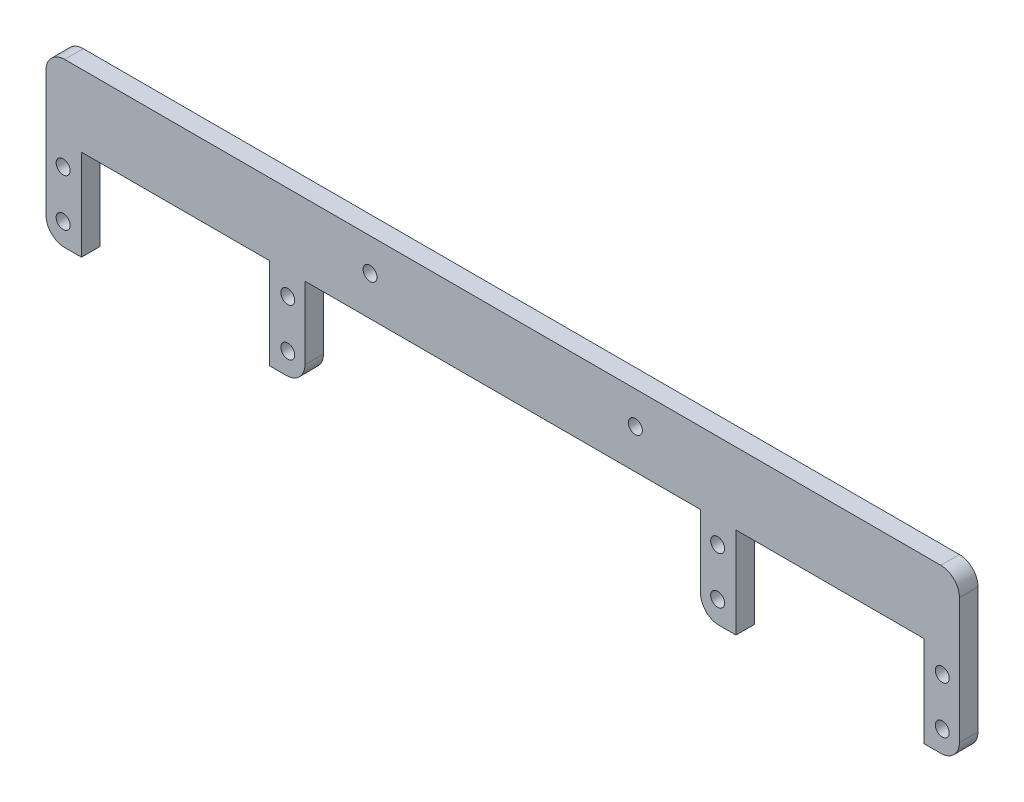
ISO-10303-21;
HEADER;
FILE_DESCRIPTION(('STEP AP214'),'2;1');
FILE_NAME('part.step','',(''),(''),'','','');
FILE_SCHEMA(('AUTOMOTIVE_DESIGN { 1 0 10303 214 1 1 1 1 }'));
ENDSEC;
DATA;
#1=APPLICATION_CONTEXT('core data for automotive mechanical design processes');
#2=APPLICATION_PROTOCOL_DEFINITION('international standard','automotive_design',2000,#1);
#3=PRODUCT_CONTEXT('',#1,'mechanical');
#4=PRODUCT('Part','Part','',(#3));
#5=PRODUCT_RELATED_PRODUCT_CATEGORY('part','',(#4));
#6=PRODUCT_DEFINITION_FORMATION('','',#4);
#7=PRODUCT_DEFINITION_CONTEXT('part definition',#1,'design');
#8=PRODUCT_DEFINITION('design','',#6,#7);
#9=PRODUCT_DEFINITION_SHAPE('','',#8);
#10=(LENGTH_UNIT() NAMED_UNIT(*) SI_UNIT(.MILLI.,.METRE.));
#11=(NAMED_UNIT(*) PLANE_ANGLE_UNIT() SI_UNIT($,.RADIAN.));
#12=(NAMED_UNIT(*) SI_UNIT($,.STERADIAN.) SOLID_ANGLE_UNIT());
#13=UNCERTAINTY_MEASURE_WITH_UNIT(LENGTH_MEASURE(1.E-05),#10,'distance_accuracy_value','');
#14=(GEOMETRIC_REPRESENTATION_CONTEXT(3) GLOBAL_UNCERTAINTY_ASSIGNED_CONTEXT((#13)) GLOBAL_UNIT_ASSIGNED_CONTEXT((#10,
#11,#12)) REPRESENTATION_CONTEXT('',''));
#15=CARTESIAN_POINT('',(0.,0.,0.));
#16=DIRECTION('',(0.,0.,1.));
#17=DIRECTION('',(1.,0.,0.));
#18=AXIS2_PLACEMENT_3D('',#15,#16,#17);
#19=CARTESIAN_POINT('',(0.,32.3655253772291,4.));
#20=DIRECTION('',(0.,1.,0.));
#21=DIRECTION('',(0.,0.,1.));
#22=AXIS2_PLACEMENT_3D('',#19,#20,#21);
#23=PLANE('',#22);
#24=DIRECTION('',(1.,0.,0.));
#25=VECTOR('',#24,1.);
#26=CARTESIAN_POINT('',(0.,32.3655253772291,0.));
#27=LINE('',#26,#25);
#28=CARTESIAN_POINT('',(-211.327093968146,32.3655253772291,0.));
#29=VERTEX_POINT('',#28);
#30=CARTESIAN_POINT('',(-23.0750939681456,32.3655253772291,0.));
#31=VERTEX_POINT('',#30);
#32=EDGE_CURVE('E258',#29,#31,#27,.T.);
#33=ORIENTED_EDGE('',*,*,#32,.F.);
#34=DIRECTION('',(0.,0.,-1.));
#35=VECTOR('',#34,1.);
#36=CARTESIAN_POINT('',(-211.327093968146,32.3655253772291,4.));
#37=LINE('',#36,#35);
#38=CARTESIAN_POINT('',(-211.327093968146,32.3655253772291,4.));
#39=VERTEX_POINT('',#38);
#40=EDGE_CURVE('E11',#29,#39,#37,.F.);
#41=ORIENTED_EDGE('',*,*,#40,.T.);
#42=DIRECTION('',(1.,0.,0.));
#43=VECTOR('',#42,1.);
#44=CARTESIAN_POINT('',(0.,32.3655253772291,4.));
#45=LINE('',#44,#43);
#46=CARTESIAN_POINT('',(-23.0750939681456,32.3655253772291,4.));
#47=VERTEX_POINT('',#46);
#48=EDGE_CURVE('E303',#39,#47,#45,.T.);
#49=ORIENTED_EDGE('',*,*,#48,.T.);
#50=DIRECTION('',(0.,0.,-1.));
#51=VECTOR('',#50,1.);
#52=CARTESIAN_POINT('',(-23.0750939681456,32.3655253772291,0.));
#53=LINE('',#52,#51);
#54=EDGE_CURVE('E42',#47,#31,#53,.T.);
#55=ORIENTED_EDGE('',*,*,#54,.T.);
#56=EDGE_LOOP('',(#33,#41,#49,#55));
#57=FACE_BOUND('',#56,.T.);
#58=ADVANCED_FACE('F34',(#57),#23,.T.);
#59=CARTESIAN_POINT('',(-215.327093968146,0.,4.));
#60=DIRECTION('',(-1.,0.,0.));
#61=DIRECTION('',(0.,0.,1.));
#62=AXIS2_PLACEMENT_3D('',#59,#60,#61);
#63=PLANE('',#62);
#64=DIRECTION('',(0.,1.,0.));
#65=VECTOR('',#64,1.);
#66=CARTESIAN_POINT('',(-215.327093968146,0.,0.));
#67=LINE('',#66,#65);
#68=CARTESIAN_POINT('',(-215.327093968146,1.36552537722908,0.));
#69=VERTEX_POINT('',#68);
#70=CARTESIAN_POINT('',(-215.327093968146,28.3655253772291,0.));
#71=VERTEX_POINT('',#70);
#72=EDGE_CURVE('E261',#69,#71,#67,.T.);
#73=ORIENTED_EDGE('',*,*,#72,.F.);
#74=DIRECTION('',(0.,0.,-1.));
#75=VECTOR('',#74,1.);
#76=CARTESIAN_POINT('',(-215.327093968146,1.36552537722908,4.));
#77=LINE('',#76,#75);
#78=CARTESIAN_POINT('',(-215.327093968146,1.36552537722908,4.));
#79=VERTEX_POINT('',#78);
#80=EDGE_CURVE('E366',#69,#79,#77,.F.);
#81=ORIENTED_EDGE('',*,*,#80,.T.);
#82=DIRECTION('',(0.,1.,0.));
#83=VECTOR('',#82,1.);
#84=CARTESIAN_POINT('',(-215.327093968146,0.,4.));
#85=LINE('',#84,#83);
#86=CARTESIAN_POINT('',(-215.327093968146,28.3655253772291,4.));
#87=VERTEX_POINT('',#86);
#88=EDGE_CURVE('E220',#79,#87,#85,.T.);
#89=ORIENTED_EDGE('',*,*,#88,.T.);
#90=DIRECTION('',(0.,0.,-1.));
#91=VECTOR('',#90,1.);
#92=CARTESIAN_POINT('',(-215.327093968146,28.3655253772291,4.));
#93=LINE('',#92,#91);
#94=EDGE_CURVE('E363',#87,#71,#93,.T.);
#95=ORIENTED_EDGE('',*,*,#94,.T.);
#96=EDGE_LOOP('',(#73,#81,#89,#95));
#97=FACE_BOUND('',#96,.T.);
#98=ADVANCED_FACE('F393',(#97),#63,.T.);
#99=CARTESIAN_POINT('',(0.,-2.63447462277092,4.));
#100=DIRECTION('',(0.,-1.,0.));
#101=DIRECTION('',(0.,0.,-1.));
#102=AXIS2_PLACEMENT_3D('',#99,#100,#101);
#103=PLANE('',#102);
#104=DIRECTION('',(-1.,0.,0.));
#105=VECTOR('',#104,1.);
#106=CARTESIAN_POINT('',(0.,-2.63447462277092,4.));
#107=LINE('',#106,#105);
#108=CARTESIAN_POINT('',(-207.707093968146,-2.63447462277092,4.));
#109=VERTEX_POINT('',#108);
#110=CARTESIAN_POINT('',(-211.327093968146,-2.63447462277092,4.));
#111=VERTEX_POINT('',#110);
#112=EDGE_CURVE('E200',#109,#111,#107,.T.);
#113=ORIENTED_EDGE('',*,*,#112,.T.);
#114=DIRECTION('',(0.,0.,-1.));
#115=VECTOR('',#114,1.);
#116=CARTESIAN_POINT('',(-211.327093968146,-2.63447462277092,4.));
#117=LINE('',#116,#115);
#118=CARTESIAN_POINT('',(-211.327093968146,-2.63447462277092,0.));
#119=VERTEX_POINT('',#118);
#120=EDGE_CURVE('E361',#111,#119,#117,.T.);
#121=ORIENTED_EDGE('',*,*,#120,.T.);
#122=DIRECTION('',(-1.,0.,0.));
#123=VECTOR('',#122,1.);
#124=CARTESIAN_POINT('',(0.,-2.63447462277092,0.));
#125=LINE('',#124,#123);
#126=CARTESIAN_POINT('',(-207.707093968146,-2.63447462277092,0.));
#127=VERTEX_POINT('',#126);
#128=EDGE_CURVE('E203',#127,#119,#125,.T.);
#129=ORIENTED_EDGE('',*,*,#128,.F.);
#130=DIRECTION('',(0.,0.,-1.));
#131=VECTOR('',#130,1.);
#132=CARTESIAN_POINT('',(-207.707093968146,-2.63447462277092,4.));
#133=LINE('',#132,#131);
#134=EDGE_CURVE('E196',#109,#127,#133,.T.);
#135=ORIENTED_EDGE('',*,*,#134,.F.);
#136=EDGE_LOOP('',(#113,#121,#129,#135));
#137=FACE_BOUND('',#136,.T.);
#138=ADVANCED_FACE('F198',(#137),#103,.T.);
#139=CARTESIAN_POINT('',(-207.707093968146,0.,4.));
#140=DIRECTION('',(1.,0.,0.));
#141=DIRECTION('',(0.,0.,-1.));
#142=AXIS2_PLACEMENT_3D('',#139,#140,#141);
#143=PLANE('',#142);
#144=DIRECTION('',(0.,-1.,0.));
#145=VECTOR('',#144,1.);
#146=CARTESIAN_POINT('',(-207.707093968146,0.,0.));
#147=LINE('',#146,#145);
#148=CARTESIAN_POINT('',(-207.707093968146,16.9235253772291,0.));
#149=VERTEX_POINT('',#148);
#150=EDGE_CURVE('E266',#149,#127,#147,.T.);
#151=ORIENTED_EDGE('',*,*,#150,.F.);
#152=DIRECTION('',(0.,0.,-1.));
#153=VECTOR('',#152,1.);
#154=CARTESIAN_POINT('',(-207.707093968146,16.9235253772291,4.));
#155=LINE('',#154,#153);
#156=CARTESIAN_POINT('',(-207.707093968146,16.9235253772291,4.));
#157=VERTEX_POINT('',#156);
#158=EDGE_CURVE('E209',#157,#149,#155,.T.);
#159=ORIENTED_EDGE('',*,*,#158,.F.);
#160=DIRECTION('',(0.,-1.,0.));
#161=VECTOR('',#160,1.);
#162=CARTESIAN_POINT('',(-207.707093968146,0.,4.));
#163=LINE('',#162,#161);
#164=EDGE_CURVE('E215',#157,#109,#163,.T.);
#165=ORIENTED_EDGE('',*,*,#164,.T.);
#166=ORIENTED_EDGE('',*,*,#134,.T.);
#167=EDGE_LOOP('',(#151,#159,#165,#166));
#168=FACE_BOUND('',#167,.T.);
#169=ADVANCED_FACE('F222',(#168),#143,.T.);
#170=CARTESIAN_POINT('',(0.,16.9235253772291,4.));
#171=DIRECTION('',(0.,-1.,0.));
#172=DIRECTION('',(0.,0.,-1.));
#173=AXIS2_PLACEMENT_3D('',#170,#171,#172);
#174=PLANE('',#173);
#175=DIRECTION('',(-1.,0.,0.));
#176=VECTOR('',#175,1.);
#177=CARTESIAN_POINT('',(0.,16.9235253772291,0.));
#178=LINE('',#177,#176);
#179=CARTESIAN_POINT('',(-167.321093968146,16.9235253772291,0.));
#180=VERTEX_POINT('',#179);
#181=EDGE_CURVE('E268',#180,#149,#178,.T.);
#182=ORIENTED_EDGE('',*,*,#181,.F.);
#183=DIRECTION('',(0.,0.,-1.));
#184=VECTOR('',#183,1.);
#185=CARTESIAN_POINT('',(-167.321093968146,16.9235253772291,4.));
#186=LINE('',#185,#184);
#187=CARTESIAN_POINT('',(-167.321093968146,16.9235253772291,4.));
#188=VERTEX_POINT('',#187);
#189=EDGE_CURVE('E327',#188,#180,#186,.T.);
#190=ORIENTED_EDGE('',*,*,#189,.F.);
#191=DIRECTION('',(-1.,0.,0.));
#192=VECTOR('',#191,1.);
#193=CARTESIAN_POINT('',(0.,16.9235253772291,4.));
#194=LINE('',#193,#192);
#195=EDGE_CURVE('E223',#188,#157,#194,.T.);
#196=ORIENTED_EDGE('',*,*,#195,.T.);
#197=ORIENTED_EDGE('',*,*,#158,.T.);
#198=EDGE_LOOP('',(#182,#190,#196,#197));
#199=FACE_BOUND('',#198,.T.);
#200=ADVANCED_FACE('F827',(#199),#174,.T.);
#201=CARTESIAN_POINT('',(-129.794494110069,-61.8400685254336,4.));
#202=DIRECTION('',(0.9027709537187,0.430121616664205,0.));
#203=DIRECTION('',(-0.430121616664205,0.9027709537187,0.));
#204=AXIS2_PLACEMENT_3D('',#201,#202,#203);
#205=PLANE('',#204);
#206=DIRECTION('',(0.430121616664205,-0.9027709537187,0.));
#207=VECTOR('',#206,1.);
#208=CARTESIAN_POINT('',(-129.794494110069,-61.8400685254336,0.));
#209=LINE('',#208,#207);
#210=CARTESIAN_POINT('',(-167.231910297222,16.7363401148836,0.));
#211=VERTEX_POINT('',#210);
#212=EDGE_CURVE('E271',#180,#211,#209,.T.);
#213=ORIENTED_EDGE('',*,*,#212,.T.);
#214=DIRECTION('',(0.,0.,-1.));
#215=VECTOR('',#214,1.);
#216=CARTESIAN_POINT('',(-167.231910297222,16.7363401148836,4.));
#217=LINE('',#216,#215);
#218=CARTESIAN_POINT('',(-167.231910297222,16.7363401148836,4.));
#219=VERTEX_POINT('',#218);
#220=EDGE_CURVE('E325',#219,#211,#217,.T.);
#221=ORIENTED_EDGE('',*,*,#220,.F.);
#222=DIRECTION('',(0.430121616664205,-0.9027709537187,0.));
#223=VECTOR('',#222,1.);
#224=CARTESIAN_POINT('',(-129.794494110069,-61.8400685254336,4.));
#225=LINE('',#224,#223);
#226=EDGE_CURVE('E225',#188,#219,#225,.T.);
#227=ORIENTED_EDGE('',*,*,#226,.F.);
#228=ORIENTED_EDGE('',*,*,#189,.T.);
#229=EDGE_LOOP('',(#213,#221,#227,#228));
#230=FACE_BOUND('',#229,.T.);
#231=ADVANCED_FACE('F817',(#230),#205,.F.);
#232=CARTESIAN_POINT('',(0.0738221222793477,15.9626026151486,4.));
#233=DIRECTION('',(0.00462464264921358,0.999989306283006,0.));
#234=DIRECTION('',(-0.999989306283006,0.00462464264921358,0.));
#235=AXIS2_PLACEMENT_3D('',#232,#233,#234);
#236=PLANE('',#235);
#237=DIRECTION('',(0.999989306283006,-0.00462464264921357,0.));
#238=VECTOR('',#237,1.);
#239=CARTESIAN_POINT('',(0.0738221222793477,15.9626026151486,0.));
#240=LINE('',#239,#238);
#241=CARTESIAN_POINT('',(-167.321093968146,16.7367525619023,0.));
#242=VERTEX_POINT('',#241);
#243=EDGE_CURVE('E274',#242,#211,#240,.T.);
#244=ORIENTED_EDGE('',*,*,#243,.F.);
#245=DIRECTION('',(0.,0.,-1.));
#246=VECTOR('',#245,1.);
#247=CARTESIAN_POINT('',(-167.321093968146,16.7367525619023,4.));
#248=LINE('',#247,#246);
#249=CARTESIAN_POINT('',(-167.321093968146,16.7367525619023,4.));
#250=VERTEX_POINT('',#249);
#251=EDGE_CURVE('E323',#250,#242,#248,.T.);
#252=ORIENTED_EDGE('',*,*,#251,.F.);
#253=DIRECTION('',(0.999989306283006,-0.00462464264921357,0.));
#254=VECTOR('',#253,1.);
#255=CARTESIAN_POINT('',(0.0738221222793477,15.9626026151486,4.));
#256=LINE('',#255,#254);
#257=EDGE_CURVE('E230',#250,#219,#256,.T.);
#258=ORIENTED_EDGE('',*,*,#257,.T.);
#259=ORIENTED_EDGE('',*,*,#220,.T.);
#260=EDGE_LOOP('',(#244,#252,#258,#259));
#261=FACE_BOUND('',#260,.T.);
#262=ADVANCED_FACE('F807',(#261),#236,.T.);
#263=CARTESIAN_POINT('',(-167.321093968146,0.,4.));
#264=DIRECTION('',(-1.,0.,0.));
#265=DIRECTION('',(0.,0.,1.));
#266=AXIS2_PLACEMENT_3D('',#263,#264,#265);
#267=PLANE('',#266);
#268=DIRECTION('',(0.,1.,0.));
#269=VECTOR('',#268,1.);
#270=CARTESIAN_POINT('',(-167.321093968146,0.,0.));
#271=LINE('',#270,#269);
#272=CARTESIAN_POINT('',(-167.321093968146,-2.63447462277092,0.));
#273=VERTEX_POINT('',#272);
#274=EDGE_CURVE('E277',#273,#242,#271,.T.);
#275=ORIENTED_EDGE('',*,*,#274,.F.);
#276=DIRECTION('',(0.,0.,-1.));
#277=VECTOR('',#276,1.);
#278=CARTESIAN_POINT('',(-167.321093968146,-2.63447462277092,4.));
#279=LINE('',#278,#277);
#280=CARTESIAN_POINT('',(-167.321093968146,-2.63447462277092,4.));
#281=VERTEX_POINT('',#280);
#282=EDGE_CURVE('E320',#281,#273,#279,.T.);
#283=ORIENTED_EDGE('',*,*,#282,.F.);
#284=DIRECTION('',(0.,1.,0.));
#285=VECTOR('',#284,1.);
#286=CARTESIAN_POINT('',(-167.321093968146,0.,4.));
#287=LINE('',#286,#285);
#288=EDGE_CURVE('E233',#281,#250,#287,.T.);
#289=ORIENTED_EDGE('',*,*,#288,.T.);
#290=ORIENTED_EDGE('',*,*,#251,.T.);
#291=EDGE_LOOP('',(#275,#283,#289,#290));
#292=FACE_BOUND('',#291,.T.);
#293=ADVANCED_FACE('F746',(#292),#267,.T.);
#294=CARTESIAN_POINT('',(0.,-2.63447462277092,4.));
#295=DIRECTION('',(0.,-1.,0.));
#296=DIRECTION('',(0.,0.,-1.));
#297=AXIS2_PLACEMENT_3D('',#294,#295,#296);
#298=PLANE('',#297);
#299=DIRECTION('',(-1.,0.,0.));
#300=VECTOR('',#299,1.);
#301=CARTESIAN_POINT('',(0.,-2.63447462277092,0.));
#302=LINE('',#301,#300);
#303=CARTESIAN_POINT('',(-163.701093968146,-2.63447462277092,0.));
#304=VERTEX_POINT('',#303);
#305=EDGE_CURVE('E280',#304,#273,#302,.T.);
#306=ORIENTED_EDGE('',*,*,#305,.F.);
#307=DIRECTION('',(0.,0.,-1.));
#308=VECTOR('',#307,1.);
#309=CARTESIAN_POINT('',(-163.701093968146,-2.63447462277092,4.));
#310=LINE('',#309,#308);
#311=CARTESIAN_POINT('',(-163.701093968146,-2.63447462277092,4.));
#312=VERTEX_POINT('',#311);
#313=EDGE_CURVE('E359',#304,#312,#310,.F.);
#314=ORIENTED_EDGE('',*,*,#313,.T.);
#315=DIRECTION('',(-1.,0.,0.));
#316=VECTOR('',#315,1.);
#317=CARTESIAN_POINT('',(0.,-2.63447462277092,4.));
#318=LINE('',#317,#316);
#319=EDGE_CURVE('E236',#312,#281,#318,.T.);
#320=ORIENTED_EDGE('',*,*,#319,.T.);
#321=ORIENTED_EDGE('',*,*,#282,.T.);
#322=EDGE_LOOP('',(#306,#314,#320,#321));
#323=FACE_BOUND('',#322,.T.);
#324=ADVANCED_FACE('F736',(#323),#298,.T.);
#325=CARTESIAN_POINT('',(-159.701093968146,0.,4.));
#326=DIRECTION('',(1.,0.,0.));
#327=DIRECTION('',(0.,0.,-1.));
#328=AXIS2_PLACEMENT_3D('',#325,#326,#327);
#329=PLANE('',#328);
#330=DIRECTION('',(0.,-1.,0.));
#331=VECTOR('',#330,1.);
#332=CARTESIAN_POINT('',(-159.701093968146,0.,4.));
#333=LINE('',#332,#331);
#334=CARTESIAN_POINT('',(-159.701093968146,16.9235253772291,4.));
#335=VERTEX_POINT('',#334);
#336=CARTESIAN_POINT('',(-159.701093968146,1.36552537722908,4.));
#337=VERTEX_POINT('',#336);
#338=EDGE_CURVE('E238',#335,#337,#333,.T.);
#339=ORIENTED_EDGE('',*,*,#338,.T.);
#340=DIRECTION('',(0.,0.,-1.));
#341=VECTOR('',#340,1.);
#342=CARTESIAN_POINT('',(-159.701093968146,1.36552537722908,4.));
#343=LINE('',#342,#341);
#344=CARTESIAN_POINT('',(-159.701093968146,1.36552537722908,0.));
#345=VERTEX_POINT('',#344);
#346=EDGE_CURVE('E356',#337,#345,#343,.T.);
#347=ORIENTED_EDGE('',*,*,#346,.T.);
#348=DIRECTION('',(0.,-1.,0.));
#349=VECTOR('',#348,1.);
#350=CARTESIAN_POINT('',(-159.701093968146,0.,0.));
#351=LINE('',#350,#349);
#352=CARTESIAN_POINT('',(-159.701093968146,16.9235253772291,0.));
#353=VERTEX_POINT('',#352);
#354=EDGE_CURVE('E282',#353,#345,#351,.T.);
#355=ORIENTED_EDGE('',*,*,#354,.F.);
#356=DIRECTION('',(0.,0.,-1.));
#357=VECTOR('',#356,1.);
#358=CARTESIAN_POINT('',(-159.701093968146,16.9235253772291,4.));
#359=LINE('',#358,#357);
#360=EDGE_CURVE('E318',#335,#353,#359,.T.);
#361=ORIENTED_EDGE('',*,*,#360,.F.);
#362=EDGE_LOOP('',(#339,#347,#355,#361));
#363=FACE_BOUND('',#362,.T.);
#364=ADVANCED_FACE('F731',(#363),#329,.T.);
#365=CARTESIAN_POINT('',(0.,16.9235253772291,4.));
#366=DIRECTION('',(0.,1.,0.));
#367=DIRECTION('',(0.,0.,1.));
#368=AXIS2_PLACEMENT_3D('',#365,#366,#367);
#369=PLANE('',#368);
#370=DIRECTION('',(1.,0.,0.));
#371=VECTOR('',#370,1.);
#372=CARTESIAN_POINT('',(0.,16.9235253772291,0.));
#373=LINE('',#372,#371);
#374=CARTESIAN_POINT('',(-74.7010939681456,16.9235253772291,0.));
#375=VERTEX_POINT('',#374);
#376=EDGE_CURVE('E285',#353,#375,#373,.T.);
#377=ORIENTED_EDGE('',*,*,#376,.T.);
#378=DIRECTION('',(0.,0.,-1.));
#379=VECTOR('',#378,1.);
#380=CARTESIAN_POINT('',(-74.7010939681456,16.9235253772291,4.));
#381=LINE('',#380,#379);
#382=CARTESIAN_POINT('',(-74.7010939681456,16.9235253772291,4.));
#383=VERTEX_POINT('',#382);
#384=EDGE_CURVE('E315',#383,#375,#381,.T.);
#385=ORIENTED_EDGE('',*,*,#384,.F.);
#386=DIRECTION('',(1.,0.,0.));
#387=VECTOR('',#386,1.);
#388=CARTESIAN_POINT('',(0.,16.9235253772291,4.));
#389=LINE('',#388,#387);
#390=EDGE_CURVE('E241',#335,#383,#389,.T.);
#391=ORIENTED_EDGE('',*,*,#390,.F.);
#392=ORIENTED_EDGE('',*,*,#360,.T.);
#393=EDGE_LOOP('',(#377,#385,#391,#392));
#394=FACE_BOUND('',#393,.T.);
#395=ADVANCED_FACE('F723',(#394),#369,.F.);
#396=CARTESIAN_POINT('',(-74.7010939681456,0.,4.));
#397=DIRECTION('',(1.,0.,0.));
#398=DIRECTION('',(0.,0.,-1.));
#399=AXIS2_PLACEMENT_3D('',#396,#397,#398);
#400=PLANE('',#399);
#401=DIRECTION('',(0.,-1.,0.));
#402=VECTOR('',#401,1.);
#403=CARTESIAN_POINT('',(-74.7010939681456,0.,0.));
#404=LINE('',#403,#402);
#405=CARTESIAN_POINT('',(-74.7010939681456,1.36552537722908,0.));
#406=VERTEX_POINT('',#405);
#407=EDGE_CURVE('E287',#375,#406,#404,.T.);
#408=ORIENTED_EDGE('',*,*,#407,.T.);
#409=DIRECTION('',(0.,0.,-1.));
#410=VECTOR('',#409,1.);
#411=CARTESIAN_POINT('',(-74.7010939681456,1.36552537722908,4.));
#412=LINE('',#411,#410);
#413=CARTESIAN_POINT('',(-74.7010939681456,1.36552537722908,4.));
#414=VERTEX_POINT('',#413);
#415=EDGE_CURVE('E344',#406,#414,#412,.F.);
#416=ORIENTED_EDGE('',*,*,#415,.T.);
#417=DIRECTION('',(0.,-1.,0.));
#418=VECTOR('',#417,1.);
#419=CARTESIAN_POINT('',(-74.7010939681456,0.,4.));
#420=LINE('',#419,#418);
#421=EDGE_CURVE('E243',#383,#414,#420,.T.);
#422=ORIENTED_EDGE('',*,*,#421,.F.);
#423=ORIENTED_EDGE('',*,*,#384,.T.);
#424=EDGE_LOOP('',(#408,#416,#422,#423));
#425=FACE_BOUND('',#424,.T.);
#426=ADVANCED_FACE('F711',(#425),#400,.F.);
#427=CARTESIAN_POINT('',(0.,-2.63447462277092,4.));
#428=DIRECTION('',(0.,1.,0.));
#429=DIRECTION('',(0.,0.,1.));
#430=AXIS2_PLACEMENT_3D('',#427,#428,#429);
#431=PLANE('',#430);
#432=DIRECTION('',(1.,0.,0.));
#433=VECTOR('',#432,1.);
#434=CARTESIAN_POINT('',(0.,-2.63447462277092,4.));
#435=LINE('',#434,#433);
#436=CARTESIAN_POINT('',(-70.7010939681456,-2.63447462277092,4.));
#437=VERTEX_POINT('',#436);
#438=CARTESIAN_POINT('',(-67.0810939681456,-2.63447462277092,4.));
#439=VERTEX_POINT('',#438);
#440=EDGE_CURVE('E245',#437,#439,#435,.T.);
#441=ORIENTED_EDGE('',*,*,#440,.F.);
#442=DIRECTION('',(0.,0.,-1.));
#443=VECTOR('',#442,1.);
#444=CARTESIAN_POINT('',(-70.7010939681456,-2.63447462277092,4.));
#445=LINE('',#444,#443);
#446=CARTESIAN_POINT('',(-70.7010939681456,-2.63447462277092,0.));
#447=VERTEX_POINT('',#446);
#448=EDGE_CURVE('E208',#437,#447,#445,.T.);
#449=ORIENTED_EDGE('',*,*,#448,.T.);
#450=DIRECTION('',(1.,0.,0.));
#451=VECTOR('',#450,1.);
#452=CARTESIAN_POINT('',(0.,-2.63447462277092,0.));
#453=LINE('',#452,#451);
#454=CARTESIAN_POINT('',(-67.0810939681456,-2.63447462277092,0.));
#455=VERTEX_POINT('',#454);
#456=EDGE_CURVE('E290',#447,#455,#453,.T.);
#457=ORIENTED_EDGE('',*,*,#456,.T.);
#458=DIRECTION('',(0.,0.,-1.));
#459=VECTOR('',#458,1.);
#460=CARTESIAN_POINT('',(-67.0810939681456,-2.63447462277092,4.));
#461=LINE('',#460,#459);
#462=EDGE_CURVE('E312',#439,#455,#461,.T.);
#463=ORIENTED_EDGE('',*,*,#462,.F.);
#464=EDGE_LOOP('',(#441,#449,#457,#463));
#465=FACE_BOUND('',#464,.T.);
#466=ADVANCED_FACE('F705',(#465),#431,.F.);
#467=CARTESIAN_POINT('',(-67.0810939681456,0.,4.));
#468=DIRECTION('',(-1.,0.,0.));
#469=DIRECTION('',(0.,0.,1.));
#470=AXIS2_PLACEMENT_3D('',#467,#468,#469);
#471=PLANE('',#470);
#472=DIRECTION('',(0.,1.,0.));
#473=VECTOR('',#472,1.);
#474=CARTESIAN_POINT('',(-67.0810939681456,0.,0.));
#475=LINE('',#474,#473);
#476=CARTESIAN_POINT('',(-67.0810939681456,16.9235253772291,0.));
#477=VERTEX_POINT('',#476);
#478=EDGE_CURVE('E292',#455,#477,#475,.T.);
#479=ORIENTED_EDGE('',*,*,#478,.T.);
#480=DIRECTION('',(0.,0.,-1.));
#481=VECTOR('',#480,1.);
#482=CARTESIAN_POINT('',(-67.0810939681456,16.9235253772291,4.));
#483=LINE('',#482,#481);
#484=CARTESIAN_POINT('',(-67.0810939681456,16.9235253772291,4.));
#485=VERTEX_POINT('',#484);
#486=EDGE_CURVE('E309',#485,#477,#483,.T.);
#487=ORIENTED_EDGE('',*,*,#486,.F.);
#488=DIRECTION('',(0.,1.,0.));
#489=VECTOR('',#488,1.);
#490=CARTESIAN_POINT('',(-67.0810939681456,0.,4.));
#491=LINE('',#490,#489);
#492=EDGE_CURVE('E247',#439,#485,#491,.T.);
#493=ORIENTED_EDGE('',*,*,#492,.F.);
#494=ORIENTED_EDGE('',*,*,#462,.T.);
#495=EDGE_LOOP('',(#479,#487,#493,#494));
#496=FACE_BOUND('',#495,.T.);
#497=ADVANCED_FACE('F710',(#496),#471,.F.);
#498=CARTESIAN_POINT('',(0.,16.9235253772291,4.));
#499=DIRECTION('',(0.,1.,0.));
#500=DIRECTION('',(0.,0.,1.));
#501=AXIS2_PLACEMENT_3D('',#498,#499,#500);
#502=PLANE('',#501);
#503=DIRECTION('',(1.,0.,0.));
#504=VECTOR('',#503,1.);
#505=CARTESIAN_POINT('',(0.,16.9235253772291,0.));
#506=LINE('',#505,#504);
#507=CARTESIAN_POINT('',(-26.6950939681456,16.9235253772291,0.));
#508=VERTEX_POINT('',#507);
#509=EDGE_CURVE('E294',#477,#508,#506,.T.);
#510=ORIENTED_EDGE('',*,*,#509,.T.);
#511=DIRECTION('',(0.,0.,-1.));
#512=VECTOR('',#511,1.);
#513=CARTESIAN_POINT('',(-26.6950939681456,16.9235253772291,4.));
#514=LINE('',#513,#512);
#515=CARTESIAN_POINT('',(-26.6950939681456,16.9235253772291,4.));
#516=VERTEX_POINT('',#515);
#517=EDGE_CURVE('E306',#516,#508,#514,.T.);
#518=ORIENTED_EDGE('',*,*,#517,.F.);
#519=DIRECTION('',(1.,0.,0.));
#520=VECTOR('',#519,1.);
#521=CARTESIAN_POINT('',(0.,16.9235253772291,4.));
#522=LINE('',#521,#520);
#523=EDGE_CURVE('E249',#485,#516,#522,.T.);
#524=ORIENTED_EDGE('',*,*,#523,.F.);
#525=ORIENTED_EDGE('',*,*,#486,.T.);
#526=EDGE_LOOP('',(#510,#518,#524,#525));
#527=FACE_BOUND('',#526,.T.);
#528=ADVANCED_FACE('F776',(#527),#502,.F.);
#529=CARTESIAN_POINT('',(-26.6950939681456,0.,4.));
#530=DIRECTION('',(1.,0.,0.));
#531=DIRECTION('',(0.,0.,-1.));
#532=AXIS2_PLACEMENT_3D('',#529,#530,#531);
#533=PLANE('',#532);
#534=DIRECTION('',(0.,-1.,0.));
#535=VECTOR('',#534,1.);
#536=CARTESIAN_POINT('',(-26.6950939681456,0.,0.));
#537=LINE('',#536,#535);
#538=CARTESIAN_POINT('',(-26.6950939681456,-2.63447462277092,0.));
#539=VERTEX_POINT('',#538);
#540=EDGE_CURVE('E296',#508,#539,#537,.T.);
#541=ORIENTED_EDGE('',*,*,#540,.T.);
#542=DIRECTION('',(0.,0.,-1.));
#543=VECTOR('',#542,1.);
#544=CARTESIAN_POINT('',(-26.6950939681456,-2.63447462277092,4.));
#545=LINE('',#544,#543);
#546=CARTESIAN_POINT('',(-26.6950939681456,-2.63447462277092,4.));
#547=VERTEX_POINT('',#546);
#548=EDGE_CURVE('E257',#547,#539,#545,.T.);
#549=ORIENTED_EDGE('',*,*,#548,.F.);
#550=DIRECTION('',(0.,-1.,0.));
#551=VECTOR('',#550,1.);
#552=CARTESIAN_POINT('',(-26.6950939681456,0.,4.));
#553=LINE('',#552,#551);
#554=EDGE_CURVE('E251',#516,#547,#553,.T.);
#555=ORIENTED_EDGE('',*,*,#554,.F.);
#556=ORIENTED_EDGE('',*,*,#517,.T.);
#557=EDGE_LOOP('',(#541,#549,#555,#556));
#558=FACE_BOUND('',#557,.T.);
#559=ADVANCED_FACE('F697',(#558),#533,.F.);
#560=CARTESIAN_POINT('',(0.,-2.63447462277092,4.));
#561=DIRECTION('',(0.,1.,0.));
#562=DIRECTION('',(0.,0.,1.));
#563=AXIS2_PLACEMENT_3D('',#560,#561,#562);
#564=PLANE('',#563);
#565=DIRECTION('',(1.,0.,0.));
#566=VECTOR('',#565,1.);
#567=CARTESIAN_POINT('',(0.,-2.63447462277092,0.));
#568=LINE('',#567,#566);
#569=CARTESIAN_POINT('',(-23.0750939681456,-2.63447462277092,0.));
#570=VERTEX_POINT('',#569);
#571=EDGE_CURVE('E298',#539,#570,#568,.T.);
#572=ORIENTED_EDGE('',*,*,#571,.T.);
#573=DIRECTION('',(0.,0.,-1.));
#574=VECTOR('',#573,1.);
#575=CARTESIAN_POINT('',(-23.0750939681456,-2.63447462277092,4.));
#576=LINE('',#575,#574);
#577=CARTESIAN_POINT('',(-23.0750939681456,-2.63447462277092,4.));
#578=VERTEX_POINT('',#577);
#579=EDGE_CURVE('E372',#570,#578,#576,.F.);
#580=ORIENTED_EDGE('',*,*,#579,.T.);
#581=DIRECTION('',(1.,0.,0.));
#582=VECTOR('',#581,1.);
#583=CARTESIAN_POINT('',(0.,-2.63447462277092,4.));
#584=LINE('',#583,#582);
#585=EDGE_CURVE('E253',#547,#578,#584,.T.);
#586=ORIENTED_EDGE('',*,*,#585,.F.);
#587=ORIENTED_EDGE('',*,*,#548,.T.);
#588=EDGE_LOOP('',(#572,#580,#586,#587));
#589=FACE_BOUND('',#588,.T.);
#590=ADVANCED_FACE('F688',(#589),#564,.F.);
#591=CARTESIAN_POINT('',(-19.0750939681456,0.,4.));
#592=DIRECTION('',(-1.,0.,0.));
#593=DIRECTION('',(0.,0.,1.));
#594=AXIS2_PLACEMENT_3D('',#591,#592,#593);
#595=PLANE('',#594);
#596=DIRECTION('',(0.,1.,0.));
#597=VECTOR('',#596,1.);
#598=CARTESIAN_POINT('',(-19.0750939681456,0.,4.));
#599=LINE('',#598,#597);
#600=CARTESIAN_POINT('',(-19.0750939681456,1.36552537722908,4.));
#601=VERTEX_POINT('',#600);
#602=CARTESIAN_POINT('',(-19.0750939681456,28.3655253772291,4.));
#603=VERTEX_POINT('',#602);
#604=EDGE_CURVE('E255',#601,#603,#599,.T.);
#605=ORIENTED_EDGE('',*,*,#604,.F.);
#606=DIRECTION('',(0.,0.,-1.));
#607=VECTOR('',#606,1.);
#608=CARTESIAN_POINT('',(-19.0750939681456,1.36552537722908,4.));
#609=LINE('',#608,#607);
#610=CARTESIAN_POINT('',(-19.0750939681456,1.36552537722908,0.));
#611=VERTEX_POINT('',#610);
#612=EDGE_CURVE('E369',#601,#611,#609,.T.);
#613=ORIENTED_EDGE('',*,*,#612,.T.);
#614=DIRECTION('',(0.,1.,0.));
#615=VECTOR('',#614,1.);
#616=CARTESIAN_POINT('',(-19.0750939681456,0.,0.));
#617=LINE('',#616,#615);
#618=CARTESIAN_POINT('',(-19.0750939681456,28.3655253772291,0.));
#619=VERTEX_POINT('',#618);
#620=EDGE_CURVE('E301',#611,#619,#617,.T.);
#621=ORIENTED_EDGE('',*,*,#620,.T.);
#622=DIRECTION('',(0.,0.,-1.));
#623=VECTOR('',#622,1.);
#624=CARTESIAN_POINT('',(-19.0750939681456,28.3655253772291,4.));
#625=LINE('',#624,#623);
#626=EDGE_CURVE('E49',#619,#603,#625,.F.);
#627=ORIENTED_EDGE('',*,*,#626,.T.);
#628=EDGE_LOOP('',(#605,#613,#621,#627));
#629=FACE_BOUND('',#628,.T.);
#630=ADVANCED_FACE('F461',(#629),#595,.F.);
#631=CARTESIAN_POINT('',(0.,0.,4.));
#632=DIRECTION('',(0.,0.,1.));
#633=DIRECTION('',(1.,0.,0.));
#634=AXIS2_PLACEMENT_3D('',#631,#632,#633);
#635=PLANE('',#634);
#636=CARTESIAN_POINT('',(-88.7010939681456,25.3655253772291,4.));
#637=DIRECTION('',(0.,0.,1.));
#638=DIRECTION('',(1.,0.,0.));
#639=AXIS2_PLACEMENT_3D('',#636,#637,#638);
#640=CIRCLE('',#639,1.5);
#641=CARTESIAN_POINT('',(-87.2010939681456,25.3655253772291,4.));
#642=VERTEX_POINT('',#641);
#643=EDGE_CURVE('E448',#642,#642,#640,.T.);
#644=ORIENTED_EDGE('',*,*,#643,.F.);
#645=EDGE_LOOP('',(#644));
#646=FACE_BOUND('',#645,.T.);
#647=CARTESIAN_POINT('',(-145.701093968146,25.3655253772291,4.));
#648=DIRECTION('',(0.,0.,1.));
#649=DIRECTION('',(1.,0.,0.));
#650=AXIS2_PLACEMENT_3D('',#647,#648,#649);
#651=CIRCLE('',#650,1.5);
#652=CARTESIAN_POINT('',(-144.201093968146,25.3655253772291,4.));
#653=VERTEX_POINT('',#652);
#654=EDGE_CURVE('E445',#653,#653,#651,.T.);
#655=ORIENTED_EDGE('',*,*,#654,.F.);
#656=EDGE_LOOP('',(#655));
#657=FACE_BOUND('',#656,.T.);
#658=CARTESIAN_POINT('',(-71.0180939681455,2.06452537722908,4.));
#659=DIRECTION('',(0.,0.,1.));
#660=DIRECTION('',(1.,0.,0.));
#661=AXIS2_PLACEMENT_3D('',#658,#659,#660);
#662=CIRCLE('',#661,1.5);
#663=CARTESIAN_POINT('',(-69.5180939681455,2.06452537722908,4.));
#664=VERTEX_POINT('',#663);
#665=EDGE_CURVE('E439',#664,#664,#662,.T.);
#666=ORIENTED_EDGE('',*,*,#665,.F.);
#667=EDGE_LOOP('',(#666));
#668=FACE_BOUND('',#667,.T.);
#669=CARTESIAN_POINT('',(-22.7580939681455,2.06452537722908,4.));
#670=DIRECTION('',(0.,0.,1.));
#671=DIRECTION('',(1.,0.,0.));
#672=AXIS2_PLACEMENT_3D('',#669,#670,#671);
#673=CIRCLE('',#672,1.5);
#674=CARTESIAN_POINT('',(-21.2580939681455,2.06452537722908,4.));
#675=VERTEX_POINT('',#674);
#676=EDGE_CURVE('E433',#675,#675,#673,.T.);
#677=ORIENTED_EDGE('',*,*,#676,.F.);
#678=EDGE_LOOP('',(#677));
#679=FACE_BOUND('',#678,.T.);
#680=CARTESIAN_POINT('',(-22.7580939681456,12.2245253772291,4.));
#681=DIRECTION('',(0.,0.,1.));
#682=DIRECTION('',(1.,0.,0.));
#683=AXIS2_PLACEMENT_3D('',#680,#681,#682);
#684=CIRCLE('',#683,1.5);
#685=CARTESIAN_POINT('',(-21.2580939681456,12.2245253772291,4.));
#686=VERTEX_POINT('',#685);
#687=EDGE_CURVE('E427',#686,#686,#684,.T.);
#688=ORIENTED_EDGE('',*,*,#687,.F.);
#689=EDGE_LOOP('',(#688));
#690=FACE_BOUND('',#689,.T.);
#691=CARTESIAN_POINT('',(-211.644093968146,2.06452537722908,4.));
#692=DIRECTION('',(0.,0.,1.));
#693=DIRECTION('',(1.,0.,0.));
#694=AXIS2_PLACEMENT_3D('',#691,#692,#693);
#695=CIRCLE('',#694,1.5);
#696=CARTESIAN_POINT('',(-210.144093968146,2.06452537722908,4.));
#697=VERTEX_POINT('',#696);
#698=EDGE_CURVE('E421',#697,#697,#695,.T.);
#699=ORIENTED_EDGE('',*,*,#698,.F.);
#700=EDGE_LOOP('',(#699));
#701=FACE_BOUND('',#700,.T.);
#702=CARTESIAN_POINT('',(-163.384093968146,2.06452537722908,4.));
#703=DIRECTION('',(0.,0.,1.));
#704=DIRECTION('',(1.,0.,0.));
#705=AXIS2_PLACEMENT_3D('',#702,#703,#704);
#706=CIRCLE('',#705,1.5);
#707=CARTESIAN_POINT('',(-161.884093968146,2.06452537722908,4.));
#708=VERTEX_POINT('',#707);
#709=EDGE_CURVE('E415',#708,#708,#706,.T.);
#710=ORIENTED_EDGE('',*,*,#709,.F.);
#711=EDGE_LOOP('',(#710));
#712=FACE_BOUND('',#711,.T.);
#713=CARTESIAN_POINT('',(-163.384093968146,12.2245253772291,4.));
#714=DIRECTION('',(0.,0.,1.));
#715=DIRECTION('',(1.,0.,0.));
#716=AXIS2_PLACEMENT_3D('',#713,#714,#715);
#717=CIRCLE('',#716,1.5);
#718=CARTESIAN_POINT('',(-161.884093968146,12.2245253772291,4.));
#719=VERTEX_POINT('',#718);
#720=EDGE_CURVE('E409',#719,#719,#717,.T.);
#721=ORIENTED_EDGE('',*,*,#720,.F.);
#722=EDGE_LOOP('',(#721));
#723=FACE_BOUND('',#722,.T.);
#724=CARTESIAN_POINT('',(-71.0180939681456,12.2245253772291,4.));
#725=DIRECTION('',(0.,0.,1.));
#726=DIRECTION('',(1.,0.,0.));
#727=AXIS2_PLACEMENT_3D('',#724,#725,#726);
#728=CIRCLE('',#727,1.5);
#729=CARTESIAN_POINT('',(-69.5180939681456,12.2245253772291,4.));
#730=VERTEX_POINT('',#729);
#731=EDGE_CURVE('E403',#730,#730,#728,.T.);
#732=ORIENTED_EDGE('',*,*,#731,.F.);
#733=EDGE_LOOP('',(#732));
#734=FACE_BOUND('',#733,.T.);
#735=CARTESIAN_POINT('',(-211.644093968146,12.2245253772291,4.));
#736=DIRECTION('',(0.,0.,1.));
#737=DIRECTION('',(1.,0.,0.));
#738=AXIS2_PLACEMENT_3D('',#735,#736,#737);
#739=CIRCLE('',#738,1.5);
#740=CARTESIAN_POINT('',(-210.144093968146,12.2245253772291,4.));
#741=VERTEX_POINT('',#740);
#742=EDGE_CURVE('E397',#741,#741,#739,.T.);
#743=ORIENTED_EDGE('',*,*,#742,.F.);
#744=EDGE_LOOP('',(#743));
#745=FACE_BOUND('',#744,.T.);
#746=ORIENTED_EDGE('',*,*,#421,.T.);
#747=CARTESIAN_POINT('',(-70.7010939681456,1.36552537722908,4.));
#748=DIRECTION('',(0.,0.,1.));
#749=DIRECTION('',(1.,0.,0.));
#750=AXIS2_PLACEMENT_3D('',#747,#748,#749);
#751=CIRCLE('',#750,4.);
#752=EDGE_CURVE('E354',#414,#437,#751,.T.);
#753=ORIENTED_EDGE('',*,*,#752,.T.);
#754=ORIENTED_EDGE('',*,*,#440,.T.);
#755=ORIENTED_EDGE('',*,*,#492,.T.);
#756=ORIENTED_EDGE('',*,*,#523,.T.);
#757=ORIENTED_EDGE('',*,*,#554,.T.);
#758=ORIENTED_EDGE('',*,*,#585,.T.);
#759=CARTESIAN_POINT('',(-23.0750939681456,1.36552537722908,4.));
#760=DIRECTION('',(0.,0.,1.));
#761=DIRECTION('',(1.,0.,0.));
#762=AXIS2_PLACEMENT_3D('',#759,#760,#761);
#763=CIRCLE('',#762,4.);
#764=EDGE_CURVE('E56',#578,#601,#763,.T.);
#765=ORIENTED_EDGE('',*,*,#764,.T.);
#766=ORIENTED_EDGE('',*,*,#604,.T.);
#767=CARTESIAN_POINT('',(-23.0750939681456,28.3655253772291,4.));
#768=DIRECTION('',(0.,0.,1.));
#769=DIRECTION('',(1.,0.,0.));
#770=AXIS2_PLACEMENT_3D('',#767,#768,#769);
#771=CIRCLE('',#770,4.);
#772=EDGE_CURVE('E346',#603,#47,#771,.T.);
#773=ORIENTED_EDGE('',*,*,#772,.T.);
#774=ORIENTED_EDGE('',*,*,#48,.F.);
#775=CARTESIAN_POINT('',(-211.327093968146,28.3655253772291,4.));
#776=DIRECTION('',(0.,0.,1.));
#777=DIRECTION('',(1.,0.,0.));
#778=AXIS2_PLACEMENT_3D('',#775,#776,#777);
#779=CIRCLE('',#778,4.);
#780=EDGE_CURVE('E348',#39,#87,#779,.T.);
#781=ORIENTED_EDGE('',*,*,#780,.T.);
#782=ORIENTED_EDGE('',*,*,#88,.F.);
#783=CARTESIAN_POINT('',(-211.327093968146,1.36552537722908,4.));
#784=DIRECTION('',(0.,0.,1.));
#785=DIRECTION('',(1.,0.,0.));
#786=AXIS2_PLACEMENT_3D('',#783,#784,#785);
#787=CIRCLE('',#786,4.);
#788=EDGE_CURVE('E219',#79,#111,#787,.T.);
#789=ORIENTED_EDGE('',*,*,#788,.T.);
#790=ORIENTED_EDGE('',*,*,#112,.F.);
#791=ORIENTED_EDGE('',*,*,#164,.F.);
#792=ORIENTED_EDGE('',*,*,#195,.F.);
#793=ORIENTED_EDGE('',*,*,#226,.T.);
#794=ORIENTED_EDGE('',*,*,#257,.F.);
#795=ORIENTED_EDGE('',*,*,#288,.F.);
#796=ORIENTED_EDGE('',*,*,#319,.F.);
#797=CARTESIAN_POINT('',(-163.701093968146,1.36552537722908,4.));
#798=DIRECTION('',(0.,0.,1.));
#799=DIRECTION('',(1.,0.,0.));
#800=AXIS2_PLACEMENT_3D('',#797,#798,#799);
#801=CIRCLE('',#800,4.);
#802=EDGE_CURVE('E352',#312,#337,#801,.T.);
#803=ORIENTED_EDGE('',*,*,#802,.T.);
#804=ORIENTED_EDGE('',*,*,#338,.F.);
#805=ORIENTED_EDGE('',*,*,#390,.T.);
#806=EDGE_LOOP('',(#746,#753,#754,#755,#756,#757,#758,#765,#766,#773,#774,#781,#782,#789,#790,
#791,#792,#793,#794,#795,#796,#803,#804,#805));
#807=FACE_BOUND('',#806,.T.);
#808=ADVANCED_FACE('F213',(#646,#657,#668,#679,#690,#701,#712,#723,#734,#745,#807),#635,.T.);
#809=CARTESIAN_POINT('',(0.,0.,0.));
#810=DIRECTION('',(0.,0.,1.));
#811=DIRECTION('',(1.,0.,0.));
#812=AXIS2_PLACEMENT_3D('',#809,#810,#811);
#813=PLANE('',#812);
#814=CARTESIAN_POINT('',(-88.7010939681456,25.3655253772291,0.));
#815=DIRECTION('',(0.,0.,1.));
#816=DIRECTION('',(1.,0.,0.));
#817=AXIS2_PLACEMENT_3D('',#814,#815,#816);
#818=CIRCLE('',#817,1.5);
#819=CARTESIAN_POINT('',(-87.2010939681456,25.3655253772291,0.));
#820=VERTEX_POINT('',#819);
#821=EDGE_CURVE('E451',#820,#820,#818,.T.);
#822=ORIENTED_EDGE('',*,*,#821,.T.);
#823=EDGE_LOOP('',(#822));
#824=FACE_BOUND('',#823,.T.);
#825=CARTESIAN_POINT('',(-145.701093968146,25.3655253772291,0.));
#826=DIRECTION('',(0.,0.,1.));
#827=DIRECTION('',(1.,0.,0.));
#828=AXIS2_PLACEMENT_3D('',#825,#826,#827);
#829=CIRCLE('',#828,1.5);
#830=CARTESIAN_POINT('',(-144.201093968146,25.3655253772291,0.));
#831=VERTEX_POINT('',#830);
#832=EDGE_CURVE('E442',#831,#831,#829,.T.);
#833=ORIENTED_EDGE('',*,*,#832,.T.);
#834=EDGE_LOOP('',(#833));
#835=FACE_BOUND('',#834,.T.);
#836=CARTESIAN_POINT('',(-71.0180939681455,2.06452537722908,0.));
#837=DIRECTION('',(0.,0.,1.));
#838=DIRECTION('',(1.,0.,0.));
#839=AXIS2_PLACEMENT_3D('',#836,#837,#838);
#840=CIRCLE('',#839,1.5);
#841=CARTESIAN_POINT('',(-69.5180939681455,2.06452537722908,0.));
#842=VERTEX_POINT('',#841);
#843=EDGE_CURVE('E436',#842,#842,#840,.T.);
#844=ORIENTED_EDGE('',*,*,#843,.T.);
#845=EDGE_LOOP('',(#844));
#846=FACE_BOUND('',#845,.T.);
#847=CARTESIAN_POINT('',(-22.7580939681455,2.06452537722908,0.));
#848=DIRECTION('',(0.,0.,1.));
#849=DIRECTION('',(1.,0.,0.));
#850=AXIS2_PLACEMENT_3D('',#847,#848,#849);
#851=CIRCLE('',#850,1.5);
#852=CARTESIAN_POINT('',(-21.2580939681455,2.06452537722908,0.));
#853=VERTEX_POINT('',#852);
#854=EDGE_CURVE('E430',#853,#853,#851,.T.);
#855=ORIENTED_EDGE('',*,*,#854,.T.);
#856=EDGE_LOOP('',(#855));
#857=FACE_BOUND('',#856,.T.);
#858=CARTESIAN_POINT('',(-22.7580939681456,12.2245253772291,0.));
#859=DIRECTION('',(0.,0.,1.));
#860=DIRECTION('',(1.,0.,0.));
#861=AXIS2_PLACEMENT_3D('',#858,#859,#860);
#862=CIRCLE('',#861,1.5);
#863=CARTESIAN_POINT('',(-21.2580939681456,12.2245253772291,0.));
#864=VERTEX_POINT('',#863);
#865=EDGE_CURVE('E424',#864,#864,#862,.T.);
#866=ORIENTED_EDGE('',*,*,#865,.T.);
#867=EDGE_LOOP('',(#866));
#868=FACE_BOUND('',#867,.T.);
#869=CARTESIAN_POINT('',(-211.644093968146,2.06452537722908,0.));
#870=DIRECTION('',(0.,0.,1.));
#871=DIRECTION('',(1.,0.,0.));
#872=AXIS2_PLACEMENT_3D('',#869,#870,#871);
#873=CIRCLE('',#872,1.5);
#874=CARTESIAN_POINT('',(-210.144093968146,2.06452537722908,0.));
#875=VERTEX_POINT('',#874);
#876=EDGE_CURVE('E418',#875,#875,#873,.T.);
#877=ORIENTED_EDGE('',*,*,#876,.T.);
#878=EDGE_LOOP('',(#877));
#879=FACE_BOUND('',#878,.T.);
#880=CARTESIAN_POINT('',(-163.384093968146,2.06452537722908,0.));
#881=DIRECTION('',(0.,0.,1.));
#882=DIRECTION('',(1.,0.,0.));
#883=AXIS2_PLACEMENT_3D('',#880,#881,#882);
#884=CIRCLE('',#883,1.5);
#885=CARTESIAN_POINT('',(-161.884093968146,2.06452537722908,0.));
#886=VERTEX_POINT('',#885);
#887=EDGE_CURVE('E412',#886,#886,#884,.T.);
#888=ORIENTED_EDGE('',*,*,#887,.T.);
#889=EDGE_LOOP('',(#888));
#890=FACE_BOUND('',#889,.T.);
#891=CARTESIAN_POINT('',(-163.384093968146,12.2245253772291,0.));
#892=DIRECTION('',(0.,0.,1.));
#893=DIRECTION('',(1.,0.,0.));
#894=AXIS2_PLACEMENT_3D('',#891,#892,#893);
#895=CIRCLE('',#894,1.5);
#896=CARTESIAN_POINT('',(-161.884093968146,12.2245253772291,0.));
#897=VERTEX_POINT('',#896);
#898=EDGE_CURVE('E406',#897,#897,#895,.T.);
#899=ORIENTED_EDGE('',*,*,#898,.T.);
#900=EDGE_LOOP('',(#899));
#901=FACE_BOUND('',#900,.T.);
#902=CARTESIAN_POINT('',(-71.0180939681456,12.2245253772291,0.));
#903=DIRECTION('',(0.,0.,1.));
#904=DIRECTION('',(1.,0.,0.));
#905=AXIS2_PLACEMENT_3D('',#902,#903,#904);
#906=CIRCLE('',#905,1.5);
#907=CARTESIAN_POINT('',(-69.5180939681456,12.2245253772291,0.));
#908=VERTEX_POINT('',#907);
#909=EDGE_CURVE('E400',#908,#908,#906,.T.);
#910=ORIENTED_EDGE('',*,*,#909,.T.);
#911=EDGE_LOOP('',(#910));
#912=FACE_BOUND('',#911,.T.);
#913=CARTESIAN_POINT('',(-211.644093968146,12.2245253772291,0.));
#914=DIRECTION('',(0.,0.,1.));
#915=DIRECTION('',(1.,0.,0.));
#916=AXIS2_PLACEMENT_3D('',#913,#914,#915);
#917=CIRCLE('',#916,1.5);
#918=CARTESIAN_POINT('',(-210.144093968146,12.2245253772291,0.));
#919=VERTEX_POINT('',#918);
#920=EDGE_CURVE('E262',#919,#919,#917,.T.);
#921=ORIENTED_EDGE('',*,*,#920,.T.);
#922=EDGE_LOOP('',(#921));
#923=FACE_BOUND('',#922,.T.);
#924=ORIENTED_EDGE('',*,*,#456,.F.);
#925=CARTESIAN_POINT('',(-70.7010939681456,1.36552537722908,0.));
#926=DIRECTION('',(0.,0.,1.));
#927=DIRECTION('',(1.,0.,0.));
#928=AXIS2_PLACEMENT_3D('',#925,#926,#927);
#929=CIRCLE('',#928,4.);
#930=EDGE_CURVE('E342',#447,#406,#929,.F.);
#931=ORIENTED_EDGE('',*,*,#930,.T.);
#932=ORIENTED_EDGE('',*,*,#407,.F.);
#933=ORIENTED_EDGE('',*,*,#376,.F.);
#934=ORIENTED_EDGE('',*,*,#354,.T.);
#935=CARTESIAN_POINT('',(-163.701093968146,1.36552537722908,0.));
#936=DIRECTION('',(0.,0.,1.));
#937=DIRECTION('',(1.,0.,0.));
#938=AXIS2_PLACEMENT_3D('',#935,#936,#937);
#939=CIRCLE('',#938,4.);
#940=EDGE_CURVE('E340',#345,#304,#939,.F.);
#941=ORIENTED_EDGE('',*,*,#940,.T.);
#942=ORIENTED_EDGE('',*,*,#305,.T.);
#943=ORIENTED_EDGE('',*,*,#274,.T.);
#944=ORIENTED_EDGE('',*,*,#243,.T.);
#945=ORIENTED_EDGE('',*,*,#212,.F.);
#946=ORIENTED_EDGE('',*,*,#181,.T.);
#947=ORIENTED_EDGE('',*,*,#150,.T.);
#948=ORIENTED_EDGE('',*,*,#128,.T.);
#949=CARTESIAN_POINT('',(-211.327093968146,1.36552537722908,0.));
#950=DIRECTION('',(0.,0.,1.));
#951=DIRECTION('',(1.,0.,0.));
#952=AXIS2_PLACEMENT_3D('',#949,#950,#951);
#953=CIRCLE('',#952,4.);
#954=EDGE_CURVE('E338',#119,#69,#953,.F.);
#955=ORIENTED_EDGE('',*,*,#954,.T.);
#956=ORIENTED_EDGE('',*,*,#72,.T.);
#957=CARTESIAN_POINT('',(-211.327093968146,28.3655253772291,0.));
#958=DIRECTION('',(0.,0.,1.));
#959=DIRECTION('',(1.,0.,0.));
#960=AXIS2_PLACEMENT_3D('',#957,#958,#959);
#961=CIRCLE('',#960,4.);
#962=EDGE_CURVE('E334',#71,#29,#961,.F.);
#963=ORIENTED_EDGE('',*,*,#962,.T.);
#964=ORIENTED_EDGE('',*,*,#32,.T.);
#965=CARTESIAN_POINT('',(-23.0750939681456,28.3655253772291,0.));
#966=DIRECTION('',(0.,0.,1.));
#967=DIRECTION('',(1.,0.,0.));
#968=AXIS2_PLACEMENT_3D('',#965,#966,#967);
#969=CIRCLE('',#968,4.);
#970=EDGE_CURVE('E332',#31,#619,#969,.F.);
#971=ORIENTED_EDGE('',*,*,#970,.T.);
#972=ORIENTED_EDGE('',*,*,#620,.F.);
#973=CARTESIAN_POINT('',(-23.0750939681456,1.36552537722908,0.));
#974=DIRECTION('',(0.,0.,1.));
#975=DIRECTION('',(1.,0.,0.));
#976=AXIS2_PLACEMENT_3D('',#973,#974,#975);
#977=CIRCLE('',#976,4.);
#978=EDGE_CURVE('E336',#611,#570,#977,.F.);
#979=ORIENTED_EDGE('',*,*,#978,.T.);
#980=ORIENTED_EDGE('',*,*,#571,.F.);
#981=ORIENTED_EDGE('',*,*,#540,.F.);
#982=ORIENTED_EDGE('',*,*,#509,.F.);
#983=ORIENTED_EDGE('',*,*,#478,.F.);
#984=EDGE_LOOP('',(#924,#931,#932,#933,#934,#941,#942,#943,#944,#945,#946,#947,#948,#955,#956,
#963,#964,#971,#972,#979,#980,#981,#982,#983));
#985=FACE_BOUND('',#984,.T.);
#986=ADVANCED_FACE('F384',(#824,#835,#846,#857,#868,#879,#890,#901,#912,#923,#985),#813,.F.);
#987=CARTESIAN_POINT('',(-70.7010939681456,1.36552537722908,4.));
#988=DIRECTION('',(0.,0.,-1.));
#989=DIRECTION('',(-1.,0.,0.));
#990=AXIS2_PLACEMENT_3D('',#987,#988,#989);
#991=CYLINDRICAL_SURFACE('',#990,4.);
#992=ORIENTED_EDGE('',*,*,#752,.F.);
#993=ORIENTED_EDGE('',*,*,#415,.F.);
#994=ORIENTED_EDGE('',*,*,#930,.F.);
#995=ORIENTED_EDGE('',*,*,#448,.F.);
#996=EDGE_LOOP('',(#992,#993,#994,#995));
#997=FACE_BOUND('',#996,.T.);
#998=ADVANCED_FACE('F502',(#997),#991,.T.);
#999=CARTESIAN_POINT('',(-163.701093968146,1.36552537722908,4.));
#1000=DIRECTION('',(0.,0.,-1.));
#1001=DIRECTION('',(-1.,0.,0.));
#1002=AXIS2_PLACEMENT_3D('',#999,#1000,#1001);
#1003=CYLINDRICAL_SURFACE('',#1002,4.);
#1004=ORIENTED_EDGE('',*,*,#802,.F.);
#1005=ORIENTED_EDGE('',*,*,#313,.F.);
#1006=ORIENTED_EDGE('',*,*,#940,.F.);
#1007=ORIENTED_EDGE('',*,*,#346,.F.);
#1008=EDGE_LOOP('',(#1004,#1005,#1006,#1007));
#1009=FACE_BOUND('',#1008,.T.);
#1010=ADVANCED_FACE('F505',(#1009),#1003,.T.);
#1011=CARTESIAN_POINT('',(-211.327093968146,1.36552537722908,4.));
#1012=DIRECTION('',(0.,0.,-1.));
#1013=DIRECTION('',(-1.,0.,0.));
#1014=AXIS2_PLACEMENT_3D('',#1011,#1012,#1013);
#1015=CYLINDRICAL_SURFACE('',#1014,4.);
#1016=ORIENTED_EDGE('',*,*,#788,.F.);
#1017=ORIENTED_EDGE('',*,*,#80,.F.);
#1018=ORIENTED_EDGE('',*,*,#954,.F.);
#1019=ORIENTED_EDGE('',*,*,#120,.F.);
#1020=EDGE_LOOP('',(#1016,#1017,#1018,#1019));
#1021=FACE_BOUND('',#1020,.T.);
#1022=ADVANCED_FACE('F509',(#1021),#1015,.T.);
#1023=CARTESIAN_POINT('',(-23.0750939681456,1.36552537722908,4.));
#1024=DIRECTION('',(0.,0.,-1.));
#1025=DIRECTION('',(-1.,0.,0.));
#1026=AXIS2_PLACEMENT_3D('',#1023,#1024,#1025);
#1027=CYLINDRICAL_SURFACE('',#1026,4.);
#1028=ORIENTED_EDGE('',*,*,#764,.F.);
#1029=ORIENTED_EDGE('',*,*,#579,.F.);
#1030=ORIENTED_EDGE('',*,*,#978,.F.);
#1031=ORIENTED_EDGE('',*,*,#612,.F.);
#1032=EDGE_LOOP('',(#1028,#1029,#1030,#1031));
#1033=FACE_BOUND('',#1032,.T.);
#1034=ADVANCED_FACE('F513',(#1033),#1027,.T.);
#1035=CARTESIAN_POINT('',(-211.327093968146,28.3655253772291,4.));
#1036=DIRECTION('',(0.,0.,-1.));
#1037=DIRECTION('',(-1.,0.,0.));
#1038=AXIS2_PLACEMENT_3D('',#1035,#1036,#1037);
#1039=CYLINDRICAL_SURFACE('',#1038,4.);
#1040=ORIENTED_EDGE('',*,*,#780,.F.);
#1041=ORIENTED_EDGE('',*,*,#40,.F.);
#1042=ORIENTED_EDGE('',*,*,#962,.F.);
#1043=ORIENTED_EDGE('',*,*,#94,.F.);
#1044=EDGE_LOOP('',(#1040,#1041,#1042,#1043));
#1045=FACE_BOUND('',#1044,.T.);
#1046=ADVANCED_FACE('F390',(#1045),#1039,.T.);
#1047=CARTESIAN_POINT('',(-23.0750939681456,28.3655253772291,4.));
#1048=DIRECTION('',(0.,0.,1.));
#1049=DIRECTION('',(1.,0.,0.));
#1050=AXIS2_PLACEMENT_3D('',#1047,#1048,#1049);
#1051=CYLINDRICAL_SURFACE('',#1050,4.);
#1052=ORIENTED_EDGE('',*,*,#772,.F.);
#1053=ORIENTED_EDGE('',*,*,#626,.F.);
#1054=ORIENTED_EDGE('',*,*,#970,.F.);
#1055=ORIENTED_EDGE('',*,*,#54,.F.);
#1056=EDGE_LOOP('',(#1052,#1053,#1054,#1055));
#1057=FACE_BOUND('',#1056,.T.);
#1058=ADVANCED_FACE('F36',(#1057),#1051,.T.);
#1059=CARTESIAN_POINT('',(-211.644093968146,12.2245253772291,0.));
#1060=DIRECTION('',(0.,0.,1.));
#1061=DIRECTION('',(1.,0.,0.));
#1062=AXIS2_PLACEMENT_3D('',#1059,#1060,#1061);
#1063=CYLINDRICAL_SURFACE('',#1062,1.5);
#1064=ORIENTED_EDGE('',*,*,#920,.F.);
#1065=EDGE_LOOP('',(#1064));
#1066=FACE_BOUND('',#1065,.T.);
#1067=ORIENTED_EDGE('',*,*,#742,.T.);
#1068=EDGE_LOOP('',(#1067));
#1069=FACE_BOUND('',#1068,.T.);
#1070=ADVANCED_FACE('F481',(#1066,#1069),#1063,.F.);
#1071=CARTESIAN_POINT('',(-71.0180939681456,12.2245253772291,0.));
#1072=DIRECTION('',(0.,0.,1.));
#1073=DIRECTION('',(1.,0.,0.));
#1074=AXIS2_PLACEMENT_3D('',#1071,#1072,#1073);
#1075=CYLINDRICAL_SURFACE('',#1074,1.5);
#1076=ORIENTED_EDGE('',*,*,#909,.F.);
#1077=EDGE_LOOP('',(#1076));
#1078=FACE_BOUND('',#1077,.T.);
#1079=ORIENTED_EDGE('',*,*,#731,.T.);
#1080=EDGE_LOOP('',(#1079));
#1081=FACE_BOUND('',#1080,.T.);
#1082=ADVANCED_FACE('F483',(#1078,#1081),#1075,.F.);
#1083=CARTESIAN_POINT('',(-163.384093968146,12.2245253772291,0.));
#1084=DIRECTION('',(0.,0.,1.));
#1085=DIRECTION('',(1.,0.,0.));
#1086=AXIS2_PLACEMENT_3D('',#1083,#1084,#1085);
#1087=CYLINDRICAL_SURFACE('',#1086,1.5);
#1088=ORIENTED_EDGE('',*,*,#898,.F.);
#1089=EDGE_LOOP('',(#1088));
#1090=FACE_BOUND('',#1089,.T.);
#1091=ORIENTED_EDGE('',*,*,#720,.T.);
#1092=EDGE_LOOP('',(#1091));
#1093=FACE_BOUND('',#1092,.T.);
#1094=ADVANCED_FACE('F490',(#1090,#1093),#1087,.F.);
#1095=CARTESIAN_POINT('',(-163.384093968146,2.06452537722908,0.));
#1096=DIRECTION('',(0.,0.,1.));
#1097=DIRECTION('',(1.,0.,0.));
#1098=AXIS2_PLACEMENT_3D('',#1095,#1096,#1097);
#1099=CYLINDRICAL_SURFACE('',#1098,1.5);
#1100=ORIENTED_EDGE('',*,*,#887,.F.);
#1101=EDGE_LOOP('',(#1100));
#1102=FACE_BOUND('',#1101,.T.);
#1103=ORIENTED_EDGE('',*,*,#709,.T.);
#1104=EDGE_LOOP('',(#1103));
#1105=FACE_BOUND('',#1104,.T.);
#1106=ADVANCED_FACE('F545',(#1102,#1105),#1099,.F.);
#1107=CARTESIAN_POINT('',(-211.644093968146,2.06452537722908,0.));
#1108=DIRECTION('',(0.,0.,1.));
#1109=DIRECTION('',(1.,0.,0.));
#1110=AXIS2_PLACEMENT_3D('',#1107,#1108,#1109);
#1111=CYLINDRICAL_SURFACE('',#1110,1.5);
#1112=ORIENTED_EDGE('',*,*,#876,.F.);
#1113=EDGE_LOOP('',(#1112));
#1114=FACE_BOUND('',#1113,.T.);
#1115=ORIENTED_EDGE('',*,*,#698,.T.);
#1116=EDGE_LOOP('',(#1115));
#1117=FACE_BOUND('',#1116,.T.);
#1118=ADVANCED_FACE('F555',(#1114,#1117),#1111,.F.);
#1119=CARTESIAN_POINT('',(-22.7580939681456,12.2245253772291,0.));
#1120=DIRECTION('',(0.,0.,1.));
#1121=DIRECTION('',(1.,0.,0.));
#1122=AXIS2_PLACEMENT_3D('',#1119,#1120,#1121);
#1123=CYLINDRICAL_SURFACE('',#1122,1.5);
#1124=ORIENTED_EDGE('',*,*,#865,.F.);
#1125=EDGE_LOOP('',(#1124));
#1126=FACE_BOUND('',#1125,.T.);
#1127=ORIENTED_EDGE('',*,*,#687,.T.);
#1128=EDGE_LOOP('',(#1127));
#1129=FACE_BOUND('',#1128,.T.);
#1130=ADVANCED_FACE('F565',(#1126,#1129),#1123,.F.);
#1131=CARTESIAN_POINT('',(-22.7580939681455,2.06452537722908,0.));
#1132=DIRECTION('',(0.,0.,1.));
#1133=DIRECTION('',(1.,0.,0.));
#1134=AXIS2_PLACEMENT_3D('',#1131,#1132,#1133);
#1135=CYLINDRICAL_SURFACE('',#1134,1.5);
#1136=ORIENTED_EDGE('',*,*,#854,.F.);
#1137=EDGE_LOOP('',(#1136));
#1138=FACE_BOUND('',#1137,.T.);
#1139=ORIENTED_EDGE('',*,*,#676,.T.);
#1140=EDGE_LOOP('',(#1139));
#1141=FACE_BOUND('',#1140,.T.);
#1142=ADVANCED_FACE('F575',(#1138,#1141),#1135,.F.);
#1143=CARTESIAN_POINT('',(-71.0180939681455,2.06452537722908,0.));
#1144=DIRECTION('',(0.,0.,1.));
#1145=DIRECTION('',(1.,0.,0.));
#1146=AXIS2_PLACEMENT_3D('',#1143,#1144,#1145);
#1147=CYLINDRICAL_SURFACE('',#1146,1.5);
#1148=ORIENTED_EDGE('',*,*,#843,.F.);
#1149=EDGE_LOOP('',(#1148));
#1150=FACE_BOUND('',#1149,.T.);
#1151=ORIENTED_EDGE('',*,*,#665,.T.);
#1152=EDGE_LOOP('',(#1151));
#1153=FACE_BOUND('',#1152,.T.);
#1154=ADVANCED_FACE('F585',(#1150,#1153),#1147,.F.);
#1155=CARTESIAN_POINT('',(-145.701093968146,25.3655253772291,0.));
#1156=DIRECTION('',(0.,0.,1.));
#1157=DIRECTION('',(1.,0.,0.));
#1158=AXIS2_PLACEMENT_3D('',#1155,#1156,#1157);
#1159=CYLINDRICAL_SURFACE('',#1158,1.5);
#1160=ORIENTED_EDGE('',*,*,#832,.F.);
#1161=EDGE_LOOP('',(#1160));
#1162=FACE_BOUND('',#1161,.T.);
#1163=ORIENTED_EDGE('',*,*,#654,.T.);
#1164=EDGE_LOOP('',(#1163));
#1165=FACE_BOUND('',#1164,.T.);
#1166=ADVANCED_FACE('F595',(#1162,#1165),#1159,.F.);
#1167=CARTESIAN_POINT('',(-88.7010939681456,25.3655253772291,0.));
#1168=DIRECTION('',(0.,0.,1.));
#1169=DIRECTION('',(1.,0.,0.));
#1170=AXIS2_PLACEMENT_3D('',#1167,#1168,#1169);
#1171=CYLINDRICAL_SURFACE('',#1170,1.5);
#1172=ORIENTED_EDGE('',*,*,#821,.F.);
#1173=EDGE_LOOP('',(#1172));
#1174=FACE_BOUND('',#1173,.T.);
#1175=ORIENTED_EDGE('',*,*,#643,.T.);
#1176=EDGE_LOOP('',(#1175));
#1177=FACE_BOUND('',#1176,.T.);
#1178=ADVANCED_FACE('F457',(#1174,#1177),#1171,.F.);
#1179=CLOSED_SHELL('',(#58,#98,#138,#169,#200,#231,#262,#293,#324,#364,#395,#426,#466,#497,#528,
#559,#590,#630,#808,#986,#998,#1010,#1022,#1034,#1046,#1058,#1070,#1082,#1094,#1106,#1118,#1130,
#1142,#1154,#1166,#1178));
#1180=MANIFOLD_SOLID_BREP('B2',#1179);
#1181=ADVANCED_BREP_SHAPE_REPRESENTATION('',(#18,#1180),#14);
#1182=SHAPE_DEFINITION_REPRESENTATION(#9,#1181);
ENDSEC;
END-ISO-10303-21;
